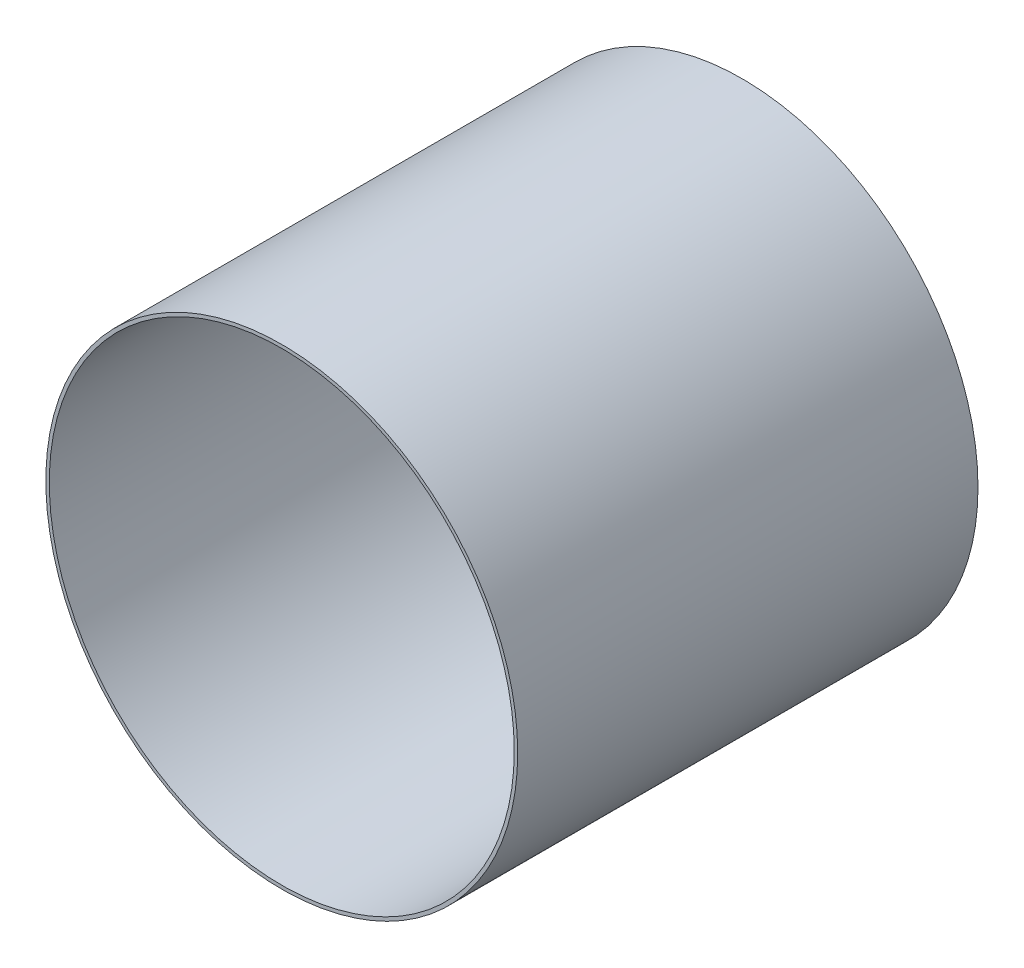
ISO-10303-21;
HEADER;
FILE_DESCRIPTION(('STEP AP214'),'2;1');
FILE_NAME('part.step','',(''),(''),'','','');
FILE_SCHEMA(('AUTOMOTIVE_DESIGN { 1 0 10303 214 1 1 1 1 }'));
ENDSEC;
DATA;
#1=APPLICATION_CONTEXT('core data for automotive mechanical design processes');
#2=APPLICATION_PROTOCOL_DEFINITION('international standard','automotive_design',2000,#1);
#3=PRODUCT_CONTEXT('',#1,'mechanical');
#4=PRODUCT('Part','Part','',(#3));
#5=PRODUCT_RELATED_PRODUCT_CATEGORY('part','',(#4));
#6=PRODUCT_DEFINITION_FORMATION('','',#4);
#7=PRODUCT_DEFINITION_CONTEXT('part definition',#1,'design');
#8=PRODUCT_DEFINITION('design','',#6,#7);
#9=PRODUCT_DEFINITION_SHAPE('','',#8);
#10=(LENGTH_UNIT() NAMED_UNIT(*) SI_UNIT(.MILLI.,.METRE.));
#11=(NAMED_UNIT(*) PLANE_ANGLE_UNIT() SI_UNIT($,.RADIAN.));
#12=(NAMED_UNIT(*) SI_UNIT($,.STERADIAN.) SOLID_ANGLE_UNIT());
#13=UNCERTAINTY_MEASURE_WITH_UNIT(LENGTH_MEASURE(1.E-05),#10,'distance_accuracy_value','');
#14=(GEOMETRIC_REPRESENTATION_CONTEXT(3) GLOBAL_UNCERTAINTY_ASSIGNED_CONTEXT((#13)) GLOBAL_UNIT_ASSIGNED_CONTEXT((#10,
#11,#12)) REPRESENTATION_CONTEXT('',''));
#15=CARTESIAN_POINT('',(0.,0.,0.));
#16=DIRECTION('',(0.,0.,1.));
#17=DIRECTION('',(1.,0.,0.));
#18=AXIS2_PLACEMENT_3D('',#15,#16,#17);
#19=CARTESIAN_POINT('',(0.,0.,975.5));
#20=DIRECTION('',(0.,0.,1.));
#21=DIRECTION('',(1.,0.,0.));
#22=AXIS2_PLACEMENT_3D('',#19,#20,#21);
#23=PLANE('',#22);
#24=CARTESIAN_POINT('',(0.,0.,975.5));
#25=DIRECTION('',(0.,0.,1.));
#26=DIRECTION('',(1.,0.,0.));
#27=AXIS2_PLACEMENT_3D('',#24,#25,#26);
#28=CIRCLE('',#27,500.);
#29=CARTESIAN_POINT('',(500.,0.,975.5));
#30=VERTEX_POINT('',#29);
#31=EDGE_CURVE('E10',#30,#30,#28,.T.);
#32=ORIENTED_EDGE('',*,*,#31,.T.);
#33=EDGE_LOOP('',(#32));
#34=FACE_BOUND('',#33,.T.);
#35=CARTESIAN_POINT('',(0.,0.,975.5));
#36=DIRECTION('',(0.,0.,1.));
#37=DIRECTION('',(1.,0.,0.));
#38=AXIS2_PLACEMENT_3D('',#35,#36,#37);
#39=CIRCLE('',#38,492.7);
#40=CARTESIAN_POINT('',(492.7,0.,975.5));
#41=VERTEX_POINT('',#40);
#42=EDGE_CURVE('E48',#41,#41,#39,.T.);
#43=ORIENTED_EDGE('',*,*,#42,.F.);
#44=EDGE_LOOP('',(#43));
#45=FACE_BOUND('',#44,.T.);
#46=ADVANCED_FACE('F37',(#34,#45),#23,.T.);
#47=CARTESIAN_POINT('',(0.,0.,0.));
#48=DIRECTION('',(0.,0.,1.));
#49=DIRECTION('',(1.,0.,0.));
#50=AXIS2_PLACEMENT_3D('',#47,#48,#49);
#51=PLANE('',#50);
#52=CARTESIAN_POINT('',(0.,0.,0.));
#53=DIRECTION('',(0.,0.,1.));
#54=DIRECTION('',(1.,0.,0.));
#55=AXIS2_PLACEMENT_3D('',#52,#53,#54);
#56=CIRCLE('',#55,500.);
#57=CARTESIAN_POINT('',(500.,0.,0.));
#58=VERTEX_POINT('',#57);
#59=EDGE_CURVE('E41',#58,#58,#56,.T.);
#60=ORIENTED_EDGE('',*,*,#59,.F.);
#61=EDGE_LOOP('',(#60));
#62=FACE_BOUND('',#61,.T.);
#63=CARTESIAN_POINT('',(0.,0.,0.));
#64=DIRECTION('',(0.,0.,1.));
#65=DIRECTION('',(1.,0.,0.));
#66=AXIS2_PLACEMENT_3D('',#63,#64,#65);
#67=CIRCLE('',#66,492.7);
#68=CARTESIAN_POINT('',(492.7,0.,0.));
#69=VERTEX_POINT('',#68);
#70=EDGE_CURVE('E50',#69,#69,#67,.T.);
#71=ORIENTED_EDGE('',*,*,#70,.T.);
#72=EDGE_LOOP('',(#71));
#73=FACE_BOUND('',#72,.T.);
#74=ADVANCED_FACE('F60',(#62,#73),#51,.F.);
#75=CARTESIAN_POINT('',(0.,0.,975.5));
#76=DIRECTION('',(0.,0.,-1.));
#77=DIRECTION('',(-1.,0.,0.));
#78=AXIS2_PLACEMENT_3D('',#75,#76,#77);
#79=CYLINDRICAL_SURFACE('',#78,500.);
#80=ORIENTED_EDGE('',*,*,#31,.F.);
#81=EDGE_LOOP('',(#80));
#82=FACE_BOUND('',#81,.T.);
#83=ORIENTED_EDGE('',*,*,#59,.T.);
#84=EDGE_LOOP('',(#83));
#85=FACE_BOUND('',#84,.T.);
#86=ADVANCED_FACE('F39',(#82,#85),#79,.T.);
#87=CARTESIAN_POINT('',(0.,0.,975.5));
#88=DIRECTION('',(0.,0.,-1.));
#89=DIRECTION('',(-1.,0.,0.));
#90=AXIS2_PLACEMENT_3D('',#87,#88,#89);
#91=CYLINDRICAL_SURFACE('',#90,492.7);
#92=ORIENTED_EDGE('',*,*,#42,.T.);
#93=EDGE_LOOP('',(#92));
#94=FACE_BOUND('',#93,.T.);
#95=ORIENTED_EDGE('',*,*,#70,.F.);
#96=EDGE_LOOP('',(#95));
#97=FACE_BOUND('',#96,.T.);
#98=ADVANCED_FACE('F56',(#94,#97),#91,.F.);
#99=CLOSED_SHELL('',(#46,#74,#86,#98));
#100=MANIFOLD_SOLID_BREP('B2',#99);
#101=ADVANCED_BREP_SHAPE_REPRESENTATION('',(#18,#100),#14);
#102=SHAPE_DEFINITION_REPRESENTATION(#9,#101);
ENDSEC;
END-ISO-10303-21;
